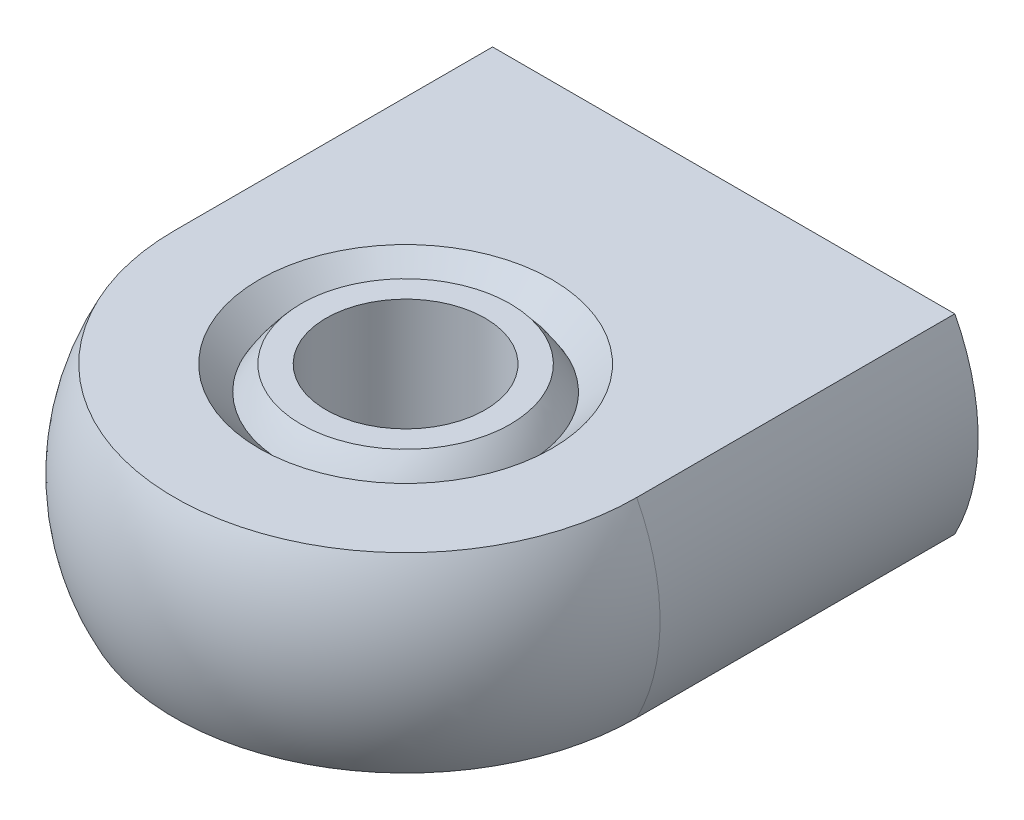
ISO-10303-21;
HEADER;
FILE_DESCRIPTION(('STEP AP214'),'2;1');
FILE_NAME('part.step','',(''),(''),'','','');
FILE_SCHEMA(('AUTOMOTIVE_DESIGN { 1 0 10303 214 1 1 1 1 }'));
ENDSEC;
DATA;
#1=APPLICATION_CONTEXT('core data for automotive mechanical design processes');
#2=APPLICATION_PROTOCOL_DEFINITION('international standard','automotive_design',2000,#1);
#3=PRODUCT_CONTEXT('',#1,'mechanical');
#4=PRODUCT('Part','Part','',(#3));
#5=PRODUCT_RELATED_PRODUCT_CATEGORY('part','',(#4));
#6=PRODUCT_DEFINITION_FORMATION('','',#4);
#7=PRODUCT_DEFINITION_CONTEXT('part definition',#1,'design');
#8=PRODUCT_DEFINITION('design','',#6,#7);
#9=PRODUCT_DEFINITION_SHAPE('','',#8);
#10=(LENGTH_UNIT() NAMED_UNIT(*) SI_UNIT(.MILLI.,.METRE.));
#11=(NAMED_UNIT(*) PLANE_ANGLE_UNIT() SI_UNIT($,.RADIAN.));
#12=(NAMED_UNIT(*) SI_UNIT($,.STERADIAN.) SOLID_ANGLE_UNIT());
#13=UNCERTAINTY_MEASURE_WITH_UNIT(LENGTH_MEASURE(1.E-05),#10,'distance_accuracy_value','');
#14=(GEOMETRIC_REPRESENTATION_CONTEXT(3) GLOBAL_UNCERTAINTY_ASSIGNED_CONTEXT((#13)) GLOBAL_UNIT_ASSIGNED_CONTEXT((#10,
#11,#12)) REPRESENTATION_CONTEXT('',''));
#15=CARTESIAN_POINT('',(0.,0.,0.));
#16=DIRECTION('',(0.,0.,1.));
#17=DIRECTION('',(1.,0.,0.));
#18=AXIS2_PLACEMENT_3D('',#15,#16,#17);
#19=CARTESIAN_POINT('',(0.,3.,10.));
#20=DIRECTION('',(0.,-1.,0.));
#21=DIRECTION('',(0.,0.,-1.));
#22=AXIS2_PLACEMENT_3D('',#19,#20,#21);
#23=PLANE('',#22);
#24=CARTESIAN_POINT('',(0.,3.,6.71463837606878));
#25=CARTESIAN_POINT('',(0.184540214436019,2.99999999999999,6.71464655939698));
#26=CARTESIAN_POINT('',(0.369214237918471,3.,6.73023910649915));
#27=CARTESIAN_POINT('',(0.733476245922316,3.,6.79222449184704));
#28=CARTESIAN_POINT('',(0.913057837587483,2.99999999999998,6.83865439971082));
#29=CARTESIAN_POINT('',(1.26180505753317,2.99999999999998,6.96099275468467));
#30=CARTESIAN_POINT('',(1.43097561574846,3.,7.03688712310791));
#31=CARTESIAN_POINT('',(1.75412653641141,3.,7.2159806981764));
#32=CARTESIAN_POINT('',(1.90811066294535,2.99999999999998,7.31917311530025));
#33=CARTESIAN_POINT('',(2.19658801520011,2.99999999999998,7.54995437004746));
#34=CARTESIAN_POINT('',(2.33107919969152,3.,7.67754575940169));
#35=CARTESIAN_POINT('',(2.57673683659356,3.,7.95350176270609));
#36=CARTESIAN_POINT('',(2.68790237304686,3.,8.10186719203514));
#37=CARTESIAN_POINT('',(2.88374490574046,3.,8.41515267583666));
#38=CARTESIAN_POINT('',(2.96842239527254,3.,8.58007242193947));
#39=CARTESIAN_POINT('',(3.10888764141324,3.,8.92178692589578));
#40=CARTESIAN_POINT('',(3.16467545611322,3.,9.09858165987025));
#41=CARTESIAN_POINT('',(3.24577806942483,3.,9.45902810274011));
#42=CARTESIAN_POINT('',(3.2710928099438,3.,9.6426798247067));
#43=CARTESIAN_POINT('',(3.29053044273158,3.,10.0116262500505));
#44=CARTESIAN_POINT('',(3.28465339120488,3.,10.1969209504665));
#45=CARTESIAN_POINT('',(3.2418743966303,3.,10.5638937671981));
#46=CARTESIAN_POINT('',(3.2049724420056,3.,10.7455718821641));
#47=CARTESIAN_POINT('',(3.1011911068813,3.,11.1001543420333));
#48=CARTESIAN_POINT('',(3.03431169473731,3.,11.2730586776747));
#49=CARTESIAN_POINT('',(2.87247397468746,3.,11.6051850672987));
#50=CARTESIAN_POINT('',(2.77751567591908,3.,11.7644071257338));
#51=CARTESIAN_POINT('',(2.56221580628186,3.,12.0646491154296));
#52=CARTESIAN_POINT('',(2.44187424568733,3.,12.2056690540579));
#53=CARTESIAN_POINT('',(2.17922395287968,3.,12.4655037579028));
#54=CARTESIAN_POINT('',(2.03691521765614,3.,12.5843185200764));
#55=CARTESIAN_POINT('',(1.73437029383715,3.,12.7963700595387));
#56=CARTESIAN_POINT('',(1.57413410289888,3.,12.8896068334847));
#57=CARTESIAN_POINT('',(1.24028292490615,3.,13.047855654279));
#58=CARTESIAN_POINT('',(1.06666793842452,3.00000000000001,13.1128677023358));
#59=CARTESIAN_POINT('',(0.71098759058229,2.99999999999999,13.2128215739559));
#60=CARTESIAN_POINT('',(0.528922229602384,2.99999999999995,13.2477633988739));
#61=CARTESIAN_POINT('',(0.161509425560859,2.99999999999995,13.2865849335575));
#62=CARTESIAN_POINT('',(-0.0238380175007591,2.99999999999999,13.2904646433232));
#63=CARTESIAN_POINT('',(-0.392553525309017,3.00000000000001,13.2670518136197));
#64=CARTESIAN_POINT('',(-0.575921589966484,2.99999999999998,13.2397592727462));
#65=CARTESIAN_POINT('',(-0.935473059733511,2.99999999999998,13.1547766926589));
#66=CARTESIAN_POINT('',(-1.11165646453545,3.,13.0970866521435));
#67=CARTESIAN_POINT('',(-1.45183725444223,3.,12.9529467322901));
#68=CARTESIAN_POINT('',(-1.61583464113957,2.99999999999998,12.8664968567104));
#69=CARTESIAN_POINT('',(-1.92698799589898,2.99999999999998,12.6672913360638));
#70=CARTESIAN_POINT('',(-2.07414396626901,3.00000000000001,12.5545356946018));
#71=CARTESIAN_POINT('',(-2.34743724622342,2.99999999999999,12.3059193850522));
#72=CARTESIAN_POINT('',(-2.47357454730012,2.99999999999995,12.1700587076124));
#73=CARTESIAN_POINT('',(-2.70124978473096,2.99999999999995,11.8790889968582));
#74=CARTESIAN_POINT('',(-2.80278771307992,2.99999999999999,11.7239799572799));
#75=CARTESIAN_POINT('',(-2.97838169242038,3.00000000000001,11.3989168237405));
#76=CARTESIAN_POINT('',(-3.05243777242186,3.,11.2289627454501));
#77=CARTESIAN_POINT('',(-3.17096595278941,3.,10.8790339511855));
#78=CARTESIAN_POINT('',(-3.21543806419461,3.,10.6990592389504));
#79=CARTESIAN_POINT('',(-3.27353597125844,3.,10.3341977316122));
#80=CARTESIAN_POINT('',(-3.28716171133485,3.,10.1493109276585));
#81=CARTESIAN_POINT('',(-3.28317992885849,3.,9.77987430593317));
#82=CARTESIAN_POINT('',(-3.26557246584732,3.,9.59532448751979));
#83=CARTESIAN_POINT('',(-3.19962411823861,3.,9.23179993121697));
#84=CARTESIAN_POINT('',(-3.15128317184201,3.,9.05282520453873));
#85=CARTESIAN_POINT('',(-3.02523900140316,3.,8.70552856034104));
#86=CARTESIAN_POINT('',(-2.94753523051581,3.,8.53720684128842));
#87=CARTESIAN_POINT('',(-2.76497448162107,3.,8.21600447004712));
#88=CARTESIAN_POINT('',(-2.660118569751,3.,8.06312321191147));
#89=CARTESIAN_POINT('',(-2.4262425699382,3.,7.77714910990541));
#90=CARTESIAN_POINT('',(-2.29722501143736,3.,7.64405419724994));
#91=CARTESIAN_POINT('',(-2.01863888071717,3.,7.40137994248345));
#92=CARTESIAN_POINT('',(-1.86906520858562,2.99999999999999,7.29180645330691));
#93=CARTESIAN_POINT('',(-1.55358670077527,3.,7.09928474640792));
#94=CARTESIAN_POINT('',(-1.38767410171386,3.00000000000002,7.01634926617226));
#95=CARTESIAN_POINT('',(-1.04441020910324,2.99999999999998,6.87960535039713));
#96=CARTESIAN_POINT('',(-0.867072914440428,2.99999999999991,6.82576199986985));
#97=CARTESIAN_POINT('',(-0.573837868394774,2.99999999999994,6.76308121486834));
#98=CARTESIAN_POINT('',(-0.459845492831498,2.99999999999998,6.74493782192496));
#99=CARTESIAN_POINT('',(-0.230586162331747,3.00000000000002,6.72071384564368));
#100=CARTESIAN_POINT('',(-0.115319207395271,3.00000000000001,6.71463326230577));
#101=CARTESIAN_POINT('',(0.,3.,6.71463837606878));
#102=B_SPLINE_CURVE_WITH_KNOTS('',3,(#24,#25,#26,#27,#28,#29,#30,#31,#32,#33,#34,#35,#36,#37,
#38,#39,#40,#41,#42,#43,#44,#45,#46,#47,#48,#49,#50,#51,#52,#53,#54,#55,#56,#57,#58,#59,#60,#61,
#62,#63,#64,#65,#66,#67,#68,#69,#70,#71,#72,#73,#74,#75,#76,#77,#78,#79,#80,#81,#82,#83,#84,#85,
#86,#87,#88,#89,#90,#91,#92,#93,#94,#95,#96,#97,#98,#99,#100,#101),.UNSPECIFIED.,.T.,.F.,(4,2,2,
2,2,2,2,2,2,2,2,2,2,2,2,2,2,2,2,2,2,2,2,2,2,2,2,2,2,2,2,2,2,2,2,2,2,2,4),(0.,0.553199728442341,
1.10706566528163,1.66066727938189,2.21413133193493,2.76765329940548,3.32119699864778,
3.87473038852956,4.42826266536216,4.98179599742512,5.53532833207654,6.08886087327669,
6.64239399879092,7.19592694417384,7.7494596655053,8.30299246269377,8.85652533221968,
9.41005817804545,9.96359099893405,10.5171238198227,11.0706566656484,11.6241895351744,
12.1777223323628,12.7312550536943,13.2847879990772,13.8383211245915,14.3918536657916,
14.945386000443,15.498919332506,16.0524516093386,16.6059849992204,17.1595286984627,
17.7130506659332,18.2665147184863,18.8201163325865,19.3739822694258,19.9271819978681,
20.2728765902918,20.6185711827156),.UNSPECIFIED.);
#103=CARTESIAN_POINT('',(0.,3.,6.71463837606878));
#104=VERTEX_POINT('',#103);
#105=EDGE_CURVE('P0_E70',#104,#104,#102,.T.);
#106=ORIENTED_EDGE('',*,*,#105,.F.);
#107=EDGE_LOOP('',(#106));
#108=FACE_BOUND('',#107,.T.);
#109=CARTESIAN_POINT('',(0.,3.,10.));
#110=DIRECTION('',(0.,-1.,0.));
#111=DIRECTION('',(0.,0.,-1.));
#112=AXIS2_PLACEMENT_3D('',#109,#110,#111);
#113=CIRCLE('',#112,2.5);
#114=CARTESIAN_POINT('',(0.,3.,7.5));
#115=VERTEX_POINT('',#114);
#116=EDGE_CURVE('P0_E75',#115,#115,#113,.T.);
#117=ORIENTED_EDGE('',*,*,#116,.T.);
#118=EDGE_LOOP('',(#117));
#119=FACE_BOUND('',#118,.T.);
#120=ADVANCED_FACE('P0_F17',(#108,#119),#23,.F.);
#121=CARTESIAN_POINT('',(0.,0.,10.));
#122=DIRECTION('',(0.,-1.,0.));
#123=DIRECTION('',(0.,0.,-1.));
#124=AXIS2_PLACEMENT_3D('',#121,#122,#123);
#125=CYLINDRICAL_SURFACE('',#124,2.5);
#126=CARTESIAN_POINT('',(0.,-3.,10.));
#127=DIRECTION('',(0.,-1.,0.));
#128=DIRECTION('',(0.,0.,-1.));
#129=AXIS2_PLACEMENT_3D('',#126,#127,#128);
#130=CIRCLE('',#129,2.5);
#131=CARTESIAN_POINT('',(0.,-3.,7.5));
#132=VERTEX_POINT('',#131);
#133=EDGE_CURVE('P0_E41',#132,#132,#130,.F.);
#134=ORIENTED_EDGE('',*,*,#133,.F.);
#135=EDGE_LOOP('',(#134));
#136=FACE_BOUND('',#135,.T.);
#137=ORIENTED_EDGE('',*,*,#116,.F.);
#138=EDGE_LOOP('',(#137));
#139=FACE_BOUND('',#138,.T.);
#140=ADVANCED_FACE('P0_F66',(#136,#139),#125,.F.);
#141=CARTESIAN_POINT('',(0.,-3.,10.));
#142=DIRECTION('',(0.,-1.,0.));
#143=DIRECTION('',(0.,0.,-1.));
#144=AXIS2_PLACEMENT_3D('',#141,#142,#143);
#145=PLANE('',#144);
#146=CARTESIAN_POINT('',(0.,-3.,13.2853616239312));
#147=CARTESIAN_POINT('',(0.184540214436019,-3.,13.285353440603));
#148=CARTESIAN_POINT('',(0.369214237918471,-3.,13.2697608935009));
#149=CARTESIAN_POINT('',(0.733476245922316,-3.,13.207775508153));
#150=CARTESIAN_POINT('',(0.913057837587483,-2.99999999999999,13.1613456002892));
#151=CARTESIAN_POINT('',(1.26180505753317,-2.99999999999999,13.0390072453153));
#152=CARTESIAN_POINT('',(1.43097561574846,-3.,12.9631128768921));
#153=CARTESIAN_POINT('',(1.7541265364114,-3.,12.7840193018236));
#154=CARTESIAN_POINT('',(1.90811066294535,-2.99999999999999,12.6808268846997));
#155=CARTESIAN_POINT('',(2.19658801520011,-2.99999999999999,12.4500456299525));
#156=CARTESIAN_POINT('',(2.33107919969152,-3.,12.3224542405983));
#157=CARTESIAN_POINT('',(2.57673683659356,-3.,12.0464982372939));
#158=CARTESIAN_POINT('',(2.68790237304687,-3.,11.8981328079649));
#159=CARTESIAN_POINT('',(2.88374490574046,-3.,11.5848473241633));
#160=CARTESIAN_POINT('',(2.96842239527254,-3.,11.4199275780605));
#161=CARTESIAN_POINT('',(3.10888764141324,-3.,11.0782130741042));
#162=CARTESIAN_POINT('',(3.16467545611322,-3.,10.9014183401298));
#163=CARTESIAN_POINT('',(3.24577806942483,-3.,10.5409718972599));
#164=CARTESIAN_POINT('',(3.2710928099438,-3.,10.3573201752933));
#165=CARTESIAN_POINT('',(3.29053044273158,-3.,9.98837374994954));
#166=CARTESIAN_POINT('',(3.28465339120488,-3.,9.80307904953347));
#167=CARTESIAN_POINT('',(3.2418743966303,-3.,9.43610623280186));
#168=CARTESIAN_POINT('',(3.2049724420056,-3.,9.25442811783587));
#169=CARTESIAN_POINT('',(3.1011911068813,-3.,8.89984565796666));
#170=CARTESIAN_POINT('',(3.03431169473731,-3.,8.72694132232532));
#171=CARTESIAN_POINT('',(2.87247397468746,-3.,8.39481493270134));
#172=CARTESIAN_POINT('',(2.77751567591908,-3.,8.23559287426622));
#173=CARTESIAN_POINT('',(2.56221580628186,-3.,7.9353508845704));
#174=CARTESIAN_POINT('',(2.44187424568733,-3.,7.79433094594213));
#175=CARTESIAN_POINT('',(2.17922395287968,-3.,7.53449624209718));
#176=CARTESIAN_POINT('',(2.03691521765614,-3.,7.41568147992355));
#177=CARTESIAN_POINT('',(1.73437029383715,-3.,7.20362994046131));
#178=CARTESIAN_POINT('',(1.57413410289888,-3.,7.11039316651531));
#179=CARTESIAN_POINT('',(1.24028292490615,-3.,6.952144345721));
#180=CARTESIAN_POINT('',(1.06666793842452,-3.00000000000001,6.88713229766421));
#181=CARTESIAN_POINT('',(0.71098759058229,-2.99999999999999,6.78717842604412));
#182=CARTESIAN_POINT('',(0.528922229602383,-2.99999999999998,6.75223660112612));
#183=CARTESIAN_POINT('',(0.161509425560859,-2.99999999999998,6.71341506644247));
#184=CARTESIAN_POINT('',(-0.023838017500759,-3.,6.70953535667681));
#185=CARTESIAN_POINT('',(-0.392553525309017,-3.,6.73294818638032));
#186=CARTESIAN_POINT('',(-0.575921589966484,-2.99999999999999,6.76024072725383));
#187=CARTESIAN_POINT('',(-0.935473059733511,-2.99999999999999,6.84522330734114));
#188=CARTESIAN_POINT('',(-1.11165646453545,-3.,6.90291334785645));
#189=CARTESIAN_POINT('',(-1.45183725444223,-3.,7.04705326770988));
#190=CARTESIAN_POINT('',(-1.61583464113957,-2.99999999999999,7.13350314328956));
#191=CARTESIAN_POINT('',(-1.92698799589898,-2.99999999999999,7.33270866393622));
#192=CARTESIAN_POINT('',(-2.074143966269,-3.,7.44546430539821));
#193=CARTESIAN_POINT('',(-2.34743724622341,-3.,7.69408061494783));
#194=CARTESIAN_POINT('',(-2.47357454730012,-2.99999999999998,7.82994129238757));
#195=CARTESIAN_POINT('',(-2.70124978473096,-2.99999999999998,8.12091100314181));
#196=CARTESIAN_POINT('',(-2.80278771307991,-2.99999999999999,8.27602004272011));
#197=CARTESIAN_POINT('',(-2.97838169242038,-3.00000000000001,8.60108317625952));
#198=CARTESIAN_POINT('',(-3.05243777242186,-3.,8.7710372545499));
#199=CARTESIAN_POINT('',(-3.17096595278941,-3.,9.12096604881453));
#200=CARTESIAN_POINT('',(-3.21543806419461,-3.,9.30094076104959));
#201=CARTESIAN_POINT('',(-3.27353597125844,-3.,9.66580226838783));
#202=CARTESIAN_POINT('',(-3.28716171133485,-3.,9.85068907234151));
#203=CARTESIAN_POINT('',(-3.28317992885849,-3.,10.2201256940668));
#204=CARTESIAN_POINT('',(-3.26557246584732,-3.,10.4046755124802));
#205=CARTESIAN_POINT('',(-3.19962411823861,-3.,10.768200068783));
#206=CARTESIAN_POINT('',(-3.15128317184201,-3.,10.9471747954613));
#207=CARTESIAN_POINT('',(-3.02523900140316,-3.,11.294471439659));
#208=CARTESIAN_POINT('',(-2.94753523051581,-3.,11.4627931587116));
#209=CARTESIAN_POINT('',(-2.76497448162107,-3.,11.7839955299529));
#210=CARTESIAN_POINT('',(-2.660118569751,-3.,11.9368767880885));
#211=CARTESIAN_POINT('',(-2.4262425699382,-3.,12.2228508900946));
#212=CARTESIAN_POINT('',(-2.29722501143736,-3.,12.3559458027501));
#213=CARTESIAN_POINT('',(-2.01863888071717,-3.,12.5986200575166));
#214=CARTESIAN_POINT('',(-1.86906520858562,-3.,12.7081935466931));
#215=CARTESIAN_POINT('',(-1.55358670077527,-3.00000000000001,12.9007152535921));
#216=CARTESIAN_POINT('',(-1.38767410171386,-3.00000000000001,12.9836507338277));
#217=CARTESIAN_POINT('',(-1.04441020910324,-2.99999999999999,13.1203946496029));
#218=CARTESIAN_POINT('',(-0.867072914440427,-2.99999999999995,13.1742380001302));
#219=CARTESIAN_POINT('',(-0.573837868394773,-2.99999999999997,13.2369187851317));
#220=CARTESIAN_POINT('',(-0.459845492831498,-2.99999999999999,13.255062178075));
#221=CARTESIAN_POINT('',(-0.230586162331747,-3.00000000000001,13.2792861543563));
#222=CARTESIAN_POINT('',(-0.115319207395271,-3.,13.2853667376942));
#223=CARTESIAN_POINT('',(0.,-3.,13.2853616239312));
#224=B_SPLINE_CURVE_WITH_KNOTS('',3,(#146,#147,#148,#149,#150,#151,#152,#153,#154,#155,#156,
#157,#158,#159,#160,#161,#162,#163,#164,#165,#166,#167,#168,#169,#170,#171,#172,#173,#174,#175,
#176,#177,#178,#179,#180,#181,#182,#183,#184,#185,#186,#187,#188,#189,#190,#191,#192,#193,#194,
#195,#196,#197,#198,#199,#200,#201,#202,#203,#204,#205,#206,#207,#208,#209,#210,#211,#212,#213,
#214,#215,#216,#217,#218,#219,#220,#221,#222,#223),.UNSPECIFIED.,.T.,.F.,(4,2,2,2,2,2,2,2,2,2,2,
2,2,2,2,2,2,2,2,2,2,2,2,2,2,2,2,2,2,2,2,2,2,2,2,2,2,2,4),(0.,0.553199728442341,1.10706566528163,
1.66066727938189,2.21413133193493,2.76765329940548,3.32119699864779,3.87473038852956,
4.42826266536216,4.98179599742512,5.53532833207654,6.08886087327669,6.64239399879092,
7.19592694417384,7.7494596655053,8.30299246269377,8.85652533221968,9.41005817804545,
9.96359099893405,10.5171238198227,11.0706566656484,11.6241895351744,12.1777223323628,
12.7312550536943,13.2847879990772,13.8383211245915,14.3918536657916,14.945386000443,
15.498919332506,16.0524516093386,16.6059849992204,17.1595286984627,17.7130506659332,
18.2665147184862,18.8201163325865,19.3739822694258,19.9271819978681,20.2728765902918,
20.6185711827156),.UNSPECIFIED.);
#225=CARTESIAN_POINT('',(0.,-3.,13.2853616239312));
#226=VERTEX_POINT('',#225);
#227=EDGE_CURVE('P0_E11',#226,#226,#224,.T.);
#228=ORIENTED_EDGE('',*,*,#227,.F.);
#229=EDGE_LOOP('',(#228));
#230=FACE_BOUND('',#229,.T.);
#231=ORIENTED_EDGE('',*,*,#133,.T.);
#232=EDGE_LOOP('',(#231));
#233=FACE_BOUND('',#232,.T.);
#234=ADVANCED_FACE('P0_F59',(#230,#233),#145,.T.);
#235=CARTESIAN_POINT('',(0.,0.,10.));
#236=DIRECTION('',(1.,0.,0.));
#237=DIRECTION('',(0.,1.,0.));
#238=AXIS2_PLACEMENT_3D('',#235,#236,#237);
#239=SPHERICAL_SURFACE('',#238,4.449);
#240=CARTESIAN_POINT('',(4.449,0.,10.));
#241=VERTEX_POINT('',#240);
#242=VERTEX_LOOP('',#241);
#243=FACE_BOUND('',#242,.T.);
#244=ORIENTED_EDGE('',*,*,#227,.T.);
#245=EDGE_LOOP('',(#244));
#246=FACE_BOUND('',#245,.T.);
#247=CARTESIAN_POINT('',(-4.449,0.,10.));
#248=CARTESIAN_POINT('',(-4.44900154419796,0.,9.9272033342173));
#249=CARTESIAN_POINT('',(-4.4472133577898,0.,9.85440679983071));
#250=CARTESIAN_POINT('',(-4.44006861152382,0.,9.70898903400392));
#251=CARTESIAN_POINT('',(-4.43471205166599,0.,9.63636780256372));
#252=CARTESIAN_POINT('',(-4.42044164626322,0.,9.49147568278385));
#253=CARTESIAN_POINT('',(-4.41152780071827,0.,9.41920479444419));
#254=CARTESIAN_POINT('',(-4.39016478494835,0.,9.275187443852));
#255=CARTESIAN_POINT('',(-4.37771561472336,0.,9.20344098159948));
#256=CARTESIAN_POINT('',(-4.34931181030458,0.,9.06064533310101));
#257=CARTESIAN_POINT('',(-4.33335717611078,0.,8.98959614685507));
#258=CARTESIAN_POINT('',(-4.29798091481427,0.,8.84836621236569));
#259=CARTESIAN_POINT('',(-4.27855928771157,0.,8.77818546412225));
#260=CARTESIAN_POINT('',(-4.23629581963362,0.,8.63886147766754));
#261=CARTESIAN_POINT('',(-4.21345397865837,0.,8.56971823945628));
#262=CARTESIAN_POINT('',(-4.16440511334015,0.,8.43263584505975));
#263=CARTESIAN_POINT('',(-4.13819808899717,0.,8.36469668887447));
#264=CARTESIAN_POINT('',(-4.08248199128826,0.,8.23018612994096));
#265=CARTESIAN_POINT('',(-4.05297291792232,0.,8.16361472719272));
#266=CARTESIAN_POINT('',(-3.99072381229007,0.,8.03200005146462));
#267=CARTESIAN_POINT('',(-3.95798378002376,0.,7.96695677848476));
#268=CARTESIAN_POINT('',(-3.8893516301479,0.,7.83855505723751));
#269=CARTESIAN_POINT('',(-3.85345951253836,0.,7.77519660897012));
#270=CARTESIAN_POINT('',(-3.77860965924406,0.,7.65031717319859));
#271=CARTESIAN_POINT('',(-3.73965192355932,0.,7.58879618569446));
#272=CARTESIAN_POINT('',(-3.65876468670873,0.,7.46773988089712));
#273=CARTESIAN_POINT('',(-3.61683518554288,0.,7.40820456360391));
#274=CARTESIAN_POINT('',(-3.5301054295719,0.,7.29126302502242));
#275=CARTESIAN_POINT('',(-3.48530517476677,0.,7.23385680373413));
#276=CARTESIAN_POINT('',(-3.39294183925486,0.,7.12131175377775));
#277=CARTESIAN_POINT('',(-3.34537875854807,0.,7.06617292510967));
#278=CARTESIAN_POINT('',(-3.24760435486035,0.,6.95829549466156));
#279=CARTESIAN_POINT('',(-3.19739303187943,0.,6.90555689288153));
#280=CARTESIAN_POINT('',(-3.09444310711847,0.,6.80260696812057));
#281=CARTESIAN_POINT('',(-3.04170450533844,0.,6.75239564513965));
#282=CARTESIAN_POINT('',(-2.93382707489033,0.,6.65462124145193));
#283=CARTESIAN_POINT('',(-2.87868824622224,0.,6.60705816074514));
#284=CARTESIAN_POINT('',(-2.76614319626587,0.,6.51469482523323));
#285=CARTESIAN_POINT('',(-2.70873697497758,0.,6.4698945704281));
#286=CARTESIAN_POINT('',(-2.59179543639609,0.,6.38316481445712));
#287=CARTESIAN_POINT('',(-2.53226011910288,0.,6.34123531329127));
#288=CARTESIAN_POINT('',(-2.41120381430554,0.,6.26034807644068));
#289=CARTESIAN_POINT('',(-2.3496828268014,0.,6.22139034075594));
#290=CARTESIAN_POINT('',(-2.22480339102988,0.,6.14654048746164));
#291=CARTESIAN_POINT('',(-2.16144494276249,0.,6.1106483698521));
#292=CARTESIAN_POINT('',(-2.03304322151524,0.,6.04201621997624));
#293=CARTESIAN_POINT('',(-1.96799994853537,0.,6.00927618770993));
#294=CARTESIAN_POINT('',(-1.83638527280727,0.,5.94702708207768));
#295=CARTESIAN_POINT('',(-1.76981387005904,0.,5.91751800871174));
#296=CARTESIAN_POINT('',(-1.63530331112553,0.,5.86180191100283));
#297=CARTESIAN_POINT('',(-1.56736415494026,0.,5.83559488665985));
#298=CARTESIAN_POINT('',(-1.43028176054372,0.,5.78654602134163));
#299=CARTESIAN_POINT('',(-1.36113852233245,0.,5.76370418036638));
#300=CARTESIAN_POINT('',(-1.22181453587775,0.,5.72144071228843));
#301=CARTESIAN_POINT('',(-1.15163378763431,0.,5.70201908518573));
#302=CARTESIAN_POINT('',(-1.01040385314493,0.,5.66664282388922));
#303=CARTESIAN_POINT('',(-0.939354666898987,0.,5.65068818969542));
#304=CARTESIAN_POINT('',(-0.796559018400521,0.,5.62228438527664));
#305=CARTESIAN_POINT('',(-0.724812556147997,0.,5.60983521505165));
#306=CARTESIAN_POINT('',(-0.580795205555811,0.,5.58847219928173));
#307=CARTESIAN_POINT('',(-0.508524317216148,0.,5.57955835373678));
#308=CARTESIAN_POINT('',(-0.363632197436281,0.,5.56528794833401));
#309=CARTESIAN_POINT('',(-0.291010965996077,0.,5.55993138847618));
#310=CARTESIAN_POINT('',(-0.145593200169287,0.,5.5527866422102));
#311=CARTESIAN_POINT('',(-0.0727966657826996,0.,5.55099845580204));
#312=CARTESIAN_POINT('',(0.,0.,5.551));
#313=B_SPLINE_CURVE_WITH_KNOTS('',3,(#247,#248,#249,#250,#251,#252,#253,#254,#255,#256,#257,
#258,#259,#260,#261,#262,#263,#264,#265,#266,#267,#268,#269,#270,#271,#272,#273,#274,#275,#276,
#277,#278,#279,#280,#281,#282,#283,#284,#285,#286,#287,#288,#289,#290,#291,#292,#293,#294,#295,
#296,#297,#298,#299,#300,#301,#302,#303,#304,#305,#306,#307,#308,#309,#310,#311,#312),
.UNSPECIFIED.,.F.,.F.,(4,2,2,2,2,2,2,2,2,2,2,2,2,2,2,2,2,2,2,2,2,2,2,2,2,2,2,2,2,2,2,2,4),(0.,
0.218367851396876,0.436735702793747,0.65510355419062,0.873471405587496,1.09183925698437,
1.31020710838124,1.52857495977811,1.74694281117499,1.96531066257186,2.18367851396874,
2.40204636536561,2.62041421676248,2.83878206815936,3.05714991955623,3.2755177709531,
3.49388562234998,3.71225347374685,3.93062132514372,4.1489891765406,4.36735702793747,
4.58572487933434,4.80409273073122,5.02246058212809,5.24082843352496,5.45919628492184,
5.67756413631871,5.89593198771558,6.11429983911246,6.33266769050933,6.5510355419062,
6.76940339330308,6.98777124469995),.UNSPECIFIED.);
#314=CARTESIAN_POINT('',(-4.449,0.,10.));
#315=VERTEX_POINT('',#314);
#316=CARTESIAN_POINT('',(0.,-7.87130777224476E-13,5.551));
#317=VERTEX_POINT('',#316);
#318=EDGE_CURVE('P0_E29',#315,#317,#313,.T.);
#319=ORIENTED_EDGE('',*,*,#318,.T.);
#320=ORIENTED_EDGE('',*,*,#318,.F.);
#321=EDGE_LOOP('',(#319,#320));
#322=FACE_BOUND('',#321,.T.);
#323=ORIENTED_EDGE('',*,*,#105,.T.);
#324=EDGE_LOOP('',(#323));
#325=FACE_BOUND('',#324,.T.);
#326=ADVANCED_FACE('P0_F39',(#243,#246,#322,#325),#239,.T.);
#327=CLOSED_SHELL('',(#120,#140,#234,#326));
#328=MANIFOLD_SOLID_BREP('P0_B1',#327);
#329=CARTESIAN_POINT('',(-5.,0.,6.50000000001683));
#330=DIRECTION('',(0.,0.,-1.));
#331=DIRECTION('',(0.,1.,0.));
#332=AXIS2_PLACEMENT_3D('',#329,#330,#331);
#333=CONICAL_SURFACE('',#332,1.25000000002274,0.785398163420186);
#334=CARTESIAN_POINT('',(-5.,0.,7.74999999993042));
#335=VERTEX_POINT('',#334);
#336=VERTEX_LOOP('',#335);
#337=FACE_BOUND('',#336,.T.);
#338=CARTESIAN_POINT('',(-5.,0.,6.5));
#339=DIRECTION('',(0.,0.,-1.));
#340=DIRECTION('',(-1.,0.,0.));
#341=AXIS2_PLACEMENT_3D('',#338,#339,#340);
#342=CIRCLE('',#341,1.25);
#343=CARTESIAN_POINT('',(-6.25,0.,6.5));
#344=VERTEX_POINT('',#343);
#345=EDGE_CURVE('P1_E204',#344,#344,#342,.T.);
#346=ORIENTED_EDGE('',*,*,#345,.T.);
#347=EDGE_LOOP('',(#346));
#348=FACE_BOUND('',#347,.T.);
#349=ADVANCED_FACE('P1_F16',(#337,#348),#333,.F.);
#350=CARTESIAN_POINT('',(5.,0.,6.50000000001683));
#351=DIRECTION('',(0.,0.,-1.));
#352=DIRECTION('',(0.,1.,0.));
#353=AXIS2_PLACEMENT_3D('',#350,#351,#352);
#354=CONICAL_SURFACE('',#353,1.25000000002274,0.785398163420186);
#355=CARTESIAN_POINT('',(5.,0.,7.74999999993042));
#356=VERTEX_POINT('',#355);
#357=VERTEX_LOOP('',#356);
#358=FACE_BOUND('',#357,.T.);
#359=CARTESIAN_POINT('',(5.,0.,6.5));
#360=DIRECTION('',(0.,0.,-1.));
#361=DIRECTION('',(-1.,0.,0.));
#362=AXIS2_PLACEMENT_3D('',#359,#360,#361);
#363=CIRCLE('',#362,1.25);
#364=CARTESIAN_POINT('',(3.75,0.,6.5));
#365=VERTEX_POINT('',#364);
#366=EDGE_CURVE('P1_E201',#365,#365,#363,.T.);
#367=ORIENTED_EDGE('',*,*,#366,.T.);
#368=EDGE_LOOP('',(#367));
#369=FACE_BOUND('',#368,.T.);
#370=ADVANCED_FACE('P1_F359',(#358,#369),#354,.F.);
#371=CARTESIAN_POINT('',(-5.,0.,3.525));
#372=DIRECTION('',(0.,0.,-1.));
#373=DIRECTION('',(-1.,0.,0.));
#374=AXIS2_PLACEMENT_3D('',#371,#372,#373);
#375=CYLINDRICAL_SURFACE('',#374,1.25);
#376=CARTESIAN_POINT('',(-5.,0.,0.549999999918782));
#377=DIRECTION('',(0.,0.,-1.));
#378=DIRECTION('',(-1.,0.,0.));
#379=AXIS2_PLACEMENT_3D('',#376,#377,#378);
#380=CIRCLE('',#379,1.25000000002274);
#381=CARTESIAN_POINT('',(-6.25000000002274,0.,0.549999999918782));
#382=VERTEX_POINT('',#381);
#383=EDGE_CURVE('P1_E198',#382,#382,#380,.T.);
#384=ORIENTED_EDGE('',*,*,#383,.T.);
#385=EDGE_LOOP('',(#384));
#386=FACE_BOUND('',#385,.T.);
#387=ORIENTED_EDGE('',*,*,#345,.F.);
#388=EDGE_LOOP('',(#387));
#389=FACE_BOUND('',#388,.T.);
#390=ADVANCED_FACE('P1_F355',(#386,#389),#375,.F.);
#391=CARTESIAN_POINT('',(5.,0.,3.525));
#392=DIRECTION('',(0.,0.,-1.));
#393=DIRECTION('',(-1.,0.,0.));
#394=AXIS2_PLACEMENT_3D('',#391,#392,#393);
#395=CYLINDRICAL_SURFACE('',#394,1.25);
#396=CARTESIAN_POINT('',(5.,0.,0.549999999918782));
#397=DIRECTION('',(0.,0.,-1.));
#398=DIRECTION('',(1.,0.,0.));
#399=AXIS2_PLACEMENT_3D('',#396,#397,#398);
#400=CIRCLE('',#399,1.25000000002274);
#401=CARTESIAN_POINT('',(6.25000000002274,0.,0.549999999918782));
#402=VERTEX_POINT('',#401);
#403=EDGE_CURVE('P1_E189',#402,#402,#400,.T.);
#404=ORIENTED_EDGE('',*,*,#403,.T.);
#405=EDGE_LOOP('',(#404));
#406=FACE_BOUND('',#405,.T.);
#407=ORIENTED_EDGE('',*,*,#366,.F.);
#408=EDGE_LOOP('',(#407));
#409=FACE_BOUND('',#408,.T.);
#410=ADVANCED_FACE('P1_F352',(#406,#409),#395,.F.);
#411=CARTESIAN_POINT('',(-5.,0.,0.200000000006639));
#412=DIRECTION('',(0.,0.,-1.));
#413=DIRECTION('',(-1.,0.,0.));
#414=AXIS2_PLACEMENT_3D('',#411,#412,#413);
#415=CONICAL_SURFACE('',#414,1.59999999993488,0.785398163397448);
#416=CARTESIAN_POINT('',(-5.,0.,0.2));
#417=DIRECTION('',(0.,0.,-1.));
#418=DIRECTION('',(-1.,0.,0.));
#419=AXIS2_PLACEMENT_3D('',#416,#417,#418);
#420=CIRCLE('',#419,1.6);
#421=CARTESIAN_POINT('',(-6.6,0.,0.2));
#422=VERTEX_POINT('',#421);
#423=EDGE_CURVE('P1_E229',#422,#422,#420,.T.);
#424=ORIENTED_EDGE('',*,*,#423,.T.);
#425=EDGE_LOOP('',(#424));
#426=FACE_BOUND('',#425,.T.);
#427=ORIENTED_EDGE('',*,*,#383,.F.);
#428=EDGE_LOOP('',(#427));
#429=FACE_BOUND('',#428,.T.);
#430=ADVANCED_FACE('P1_F347',(#426,#429),#415,.F.);
#431=CARTESIAN_POINT('',(5.,0.,0.200000000006639));
#432=DIRECTION('',(0.,0.,-1.));
#433=DIRECTION('',(-1.,0.,0.));
#434=AXIS2_PLACEMENT_3D('',#431,#432,#433);
#435=CONICAL_SURFACE('',#434,1.59999999993488,0.785398163397448);
#436=CARTESIAN_POINT('',(5.,0.,0.2));
#437=DIRECTION('',(0.,0.,-1.));
#438=DIRECTION('',(-1.,0.,0.));
#439=AXIS2_PLACEMENT_3D('',#436,#437,#438);
#440=CIRCLE('',#439,1.6);
#441=CARTESIAN_POINT('',(3.4,0.,0.2));
#442=VERTEX_POINT('',#441);
#443=EDGE_CURVE('P1_E164',#442,#442,#440,.T.);
#444=ORIENTED_EDGE('',*,*,#443,.T.);
#445=EDGE_LOOP('',(#444));
#446=FACE_BOUND('',#445,.T.);
#447=ORIENTED_EDGE('',*,*,#403,.F.);
#448=EDGE_LOOP('',(#447));
#449=FACE_BOUND('',#448,.T.);
#450=ADVANCED_FACE('P1_F236',(#446,#449),#435,.F.);
#451=CARTESIAN_POINT('',(0.,0.,4.));
#452=DIRECTION('',(0.,0.,1.));
#453=DIRECTION('',(1.,0.,0.));
#454=AXIS2_PLACEMENT_3D('',#451,#452,#453);
#455=PLANE('',#454);
#456=DIRECTION('',(1.,0.,0.));
#457=VECTOR('',#456,1.);
#458=CARTESIAN_POINT('',(0.,-2.,4.));
#459=LINE('',#458,#457);
#460=CARTESIAN_POINT('',(-2.25,-2.,4.));
#461=VERTEX_POINT('',#460);
#462=CARTESIAN_POINT('',(2.25,-2.,4.));
#463=VERTEX_POINT('',#462);
#464=EDGE_CURVE('P1_E63',#461,#463,#459,.T.);
#465=ORIENTED_EDGE('',*,*,#464,.F.);
#466=DIRECTION('',(0.,1.,0.));
#467=VECTOR('',#466,1.);
#468=CARTESIAN_POINT('',(-2.25,0.,4.));
#469=LINE('',#468,#467);
#470=CARTESIAN_POINT('',(-2.25,2.,4.));
#471=VERTEX_POINT('',#470);
#472=EDGE_CURVE('P1_E155',#471,#461,#469,.F.);
#473=ORIENTED_EDGE('',*,*,#472,.F.);
#474=DIRECTION('',(1.,0.,0.));
#475=VECTOR('',#474,1.);
#476=CARTESIAN_POINT('',(0.,2.,4.));
#477=LINE('',#476,#475);
#478=CARTESIAN_POINT('',(2.25,2.,4.));
#479=VERTEX_POINT('',#478);
#480=EDGE_CURVE('P1_E159',#479,#471,#477,.F.);
#481=ORIENTED_EDGE('',*,*,#480,.F.);
#482=DIRECTION('',(0.,1.,0.));
#483=VECTOR('',#482,1.);
#484=CARTESIAN_POINT('',(2.25,0.,4.));
#485=LINE('',#484,#483);
#486=EDGE_CURVE('P1_E122',#463,#479,#485,.T.);
#487=ORIENTED_EDGE('',*,*,#486,.F.);
#488=EDGE_LOOP('',(#465,#473,#481,#487));
#489=FACE_BOUND('',#488,.T.);
#490=ADVANCED_FACE('P1_F340',(#489),#455,.F.);
#491=CARTESIAN_POINT('',(0.,2.99999999992906,10.));
#492=DIRECTION('',(0.,1.,0.));
#493=DIRECTION('',(0.,0.,1.));
#494=AXIS2_PLACEMENT_3D('',#491,#492,#493);
#495=CONICAL_SURFACE('',#494,4.59999999992533,0.785398163397448);
#496=CARTESIAN_POINT('',(0.,3.00000000004275,10.));
#497=DIRECTION('',(0.,1.,0.));
#498=DIRECTION('',(0.,0.,1.));
#499=AXIS2_PLACEMENT_3D('',#496,#497,#498);
#500=CIRCLE('',#499,4.60000000003902);
#501=CARTESIAN_POINT('',(0.,3.00000000004275,14.600000000039));
#502=VERTEX_POINT('',#501);
#503=EDGE_CURVE('P1_E152',#502,#502,#500,.F.);
#504=ORIENTED_EDGE('',*,*,#503,.F.);
#505=EDGE_LOOP('',(#504));
#506=FACE_BOUND('',#505,.T.);
#507=CARTESIAN_POINT('',(0.,2.24323019176609,10.));
#508=DIRECTION('',(0.,1.,0.));
#509=DIRECTION('',(0.,0.,1.));
#510=AXIS2_PLACEMENT_3D('',#507,#508,#509);
#511=CIRCLE('',#510,3.84323019176236);
#512=CARTESIAN_POINT('',(0.,2.24323019176609,13.8432301917624));
#513=VERTEX_POINT('',#512);
#514=EDGE_CURVE('P1_E197',#513,#513,#511,.T.);
#515=ORIENTED_EDGE('',*,*,#514,.F.);
#516=EDGE_LOOP('',(#515));
#517=FACE_BOUND('',#516,.T.);
#518=ADVANCED_FACE('P1_F179',(#506,#517),#495,.F.);
#519=CARTESIAN_POINT('',(0.,0.,10.));
#520=DIRECTION('',(1.,0.,0.));
#521=DIRECTION('',(0.,1.,0.));
#522=AXIS2_PLACEMENT_3D('',#519,#520,#521);
#523=SPHERICAL_SURFACE('',#522,4.45);
#524=CARTESIAN_POINT('',(4.45,0.,10.));
#525=VERTEX_POINT('',#524);
#526=VERTEX_LOOP('',#525);
#527=FACE_BOUND('',#526,.T.);
#528=CARTESIAN_POINT('',(0.,-2.24323019170924,10.));
#529=DIRECTION('',(0.,-1.,0.));
#530=DIRECTION('',(0.,0.,-1.));
#531=AXIS2_PLACEMENT_3D('',#528,#529,#530);
#532=CIRCLE('',#531,3.84323019170551);
#533=CARTESIAN_POINT('',(0.,-2.24323019170924,6.15676980829449));
#534=VERTEX_POINT('',#533);
#535=EDGE_CURVE('P1_E150',#534,#534,#532,.T.);
#536=ORIENTED_EDGE('',*,*,#535,.T.);
#537=EDGE_LOOP('',(#536));
#538=FACE_BOUND('',#537,.T.);
#539=CARTESIAN_POINT('',(-4.45,0.,10.));
#540=CARTESIAN_POINT('',(-4.45000154454505,5.61577489458772E-13,9.92718697173904));
#541=CARTESIAN_POINT('',(-4.44821295620693,1.08751105102652E-12,9.85437407490372));
#542=CARTESIAN_POINT('',(-4.4410666040191,2.07121842501265E-12,9.70892362358225));
#543=CARTESIAN_POINT('',(-4.4357088401694,2.52899223743104E-12,9.6362860690961));
#544=CARTESIAN_POINT('',(-4.42143522721315,3.37950821975114E-12,9.49136138197081));
#545=CARTESIAN_POINT('',(-4.41251937810661,3.77225038965285E-12,9.41907424933168));
#546=CARTESIAN_POINT('',(-4.39115156057994,4.49392661682134E-12,9.2750245280156));
#547=CARTESIAN_POINT('',(-4.37869959215981,4.82286067408813E-12,9.20326193933865));
#548=CARTESIAN_POINT('',(-4.35028940342895,5.42130703678984E-12,9.0604341947178));
#549=CARTESIAN_POINT('',(-4.33433118311822,5.69081934222477E-12,8.98936903877389));
#550=CARTESIAN_POINT('',(-4.29894697031322,6.17298927902616E-12,8.84810736008705));
#551=CARTESIAN_POINT('',(-4.27952097781895,6.38564691039263E-12,8.77791083734412));
#552=CARTESIAN_POINT('',(-4.23724801019771,6.75756963205088E-12,8.63855553509116));
#553=CARTESIAN_POINT('',(-4.21440103507075,6.91683472234266E-12,8.56939675558113));
#554=CARTESIAN_POINT('',(-4.16534114505814,7.18608942161072E-12,8.43228354922811));
#555=CARTESIAN_POINT('',(-4.13912823017249,7.296079030587E-12,8.36432912238512));
#556=CARTESIAN_POINT('',(-4.08339960917796,7.46847348086615E-12,8.22978832956558));
#557=CARTESIAN_POINT('',(-4.05388390306908,7.53087832216901E-12,8.16320196358904));
#558=CARTESIAN_POINT('',(-3.99162080572956,7.6163830333927E-12,8.03155770488145));
#559=CARTESIAN_POINT('',(-3.95887341449893,7.63948290331353E-12,7.96649981215042));
#560=CARTESIAN_POINT('',(-3.89022583820143,7.64499306686656E-12,7.83806923009821));
#561=CARTESIAN_POINT('',(-3.85432565313457,7.62740336049875E-12,7.77469654077703));
#562=CARTESIAN_POINT('',(-3.77945897586786,7.55845016675165E-12,7.64978903590329));
#563=CARTESIAN_POINT('',(-3.74049248366801,7.50708667937235E-12,7.58825422035072));
#564=CARTESIAN_POINT('',(-3.65958706582464,7.37535727898314E-12,7.46717070577482));
#565=CARTESIAN_POINT('',(-3.61764814018112,7.29499136597323E-12,7.4076220067515));
#566=CARTESIAN_POINT('',(-3.53089888999662,7.10848847271244E-12,7.29065418326585));
#567=CARTESIAN_POINT('',(-3.48608856545564,7.00235149246157E-12,7.23323505880352));
#568=CARTESIAN_POINT('',(-3.39370446947272,6.76709940024444E-12,7.12066471214003));
#569=CARTESIAN_POINT('',(-3.34613069803078,6.63798428827819E-12,7.06551348993887));
#570=CARTESIAN_POINT('',(-3.24833431762836,6.36151050066626E-12,6.95761181192267));
#571=CARTESIAN_POINT('',(-3.19811170866789,6.21415182502059E-12,6.90486135610762));
#572=CARTESIAN_POINT('',(-3.09513864389238,5.90838085631533E-12,6.80188829133211));
#573=CARTESIAN_POINT('',(-3.04238818807733,5.74996856325574E-12,6.75166568237164));
#574=CARTESIAN_POINT('',(-2.93448651006113,5.41823636490206E-12,6.65386930196922));
#575=CARTESIAN_POINT('',(-2.87933528785997,5.24491645960796E-12,6.60629553052728));
#576=CARTESIAN_POINT('',(-2.76676494119648,4.89722269425434E-12,6.51391143454436));
#577=CARTESIAN_POINT('',(-2.70934581673415,4.72284883419481E-12,6.46910111000338));
#578=CARTESIAN_POINT('',(-2.5923779932485,4.36787121174202E-12,6.38235185981888));
#579=CARTESIAN_POINT('',(-2.53282929422518,4.18726744934875E-12,6.34041293417536));
#580=CARTESIAN_POINT('',(-2.41174577964928,3.82993414919799E-12,6.25950751633199));
#581=CARTESIAN_POINT('',(-2.35021096409671,3.6532046114405E-12,6.22054102413215));
#582=CARTESIAN_POINT('',(-2.22530345922296,3.30184008516237E-12,6.14567434686543));
#583=CARTESIAN_POINT('',(-2.16193076990179,3.12720509664172E-12,6.10977416179857));
#584=CARTESIAN_POINT('',(-2.03350018784959,2.78310073085912E-12,6.04112658550107));
#585=CARTESIAN_POINT('',(-1.96844229511855,2.61363135359716E-12,6.00837919427044));
#586=CARTESIAN_POINT('',(-1.83679803641096,2.28693946051864E-12,5.94611609693092));
#587=CARTESIAN_POINT('',(-1.77021167043442,2.12971694470207E-12,5.91660039082204));
#588=CARTESIAN_POINT('',(-1.63567087761488,1.82703750744168E-12,5.86087176982751));
#589=CARTESIAN_POINT('',(-1.56771645077189,1.68158058599786E-12,5.83465885494186));
#590=CARTESIAN_POINT('',(-1.43060324441887,1.40560313965851E-12,5.78559896492925));
#591=CARTESIAN_POINT('',(-1.36144446490884,1.27508261476299E-12,5.76275198980229));
#592=CARTESIAN_POINT('',(-1.22208916265588,1.03049805847691E-12,5.72047902218105));
#593=CARTESIAN_POINT('',(-1.15189263991294,9.16434027086366E-13,5.70105302968678));
#594=CARTESIAN_POINT('',(-1.0106309612261,7.07573031040148E-13,5.66566881688178));
#595=CARTESIAN_POINT('',(-0.939565805282198,6.1277606638448E-13,5.64971059657105));
#596=CARTESIAN_POINT('',(-0.796738060661345,4.40014796979259E-13,5.6213004078402));
#597=CARTESIAN_POINT('',(-0.724975471984399,3.62050492229706E-13,5.60884843942006));
#598=CARTESIAN_POINT('',(-0.580925750668321,2.30593820837995E-13,5.58748062189339));
#599=CARTESIAN_POINT('',(-0.508638618029189,1.77101454195837E-13,5.57856477278685));
#600=CARTESIAN_POINT('',(-0.363713930903901,0.,5.5642911598306));
#601=CARTESIAN_POINT('',(-0.291076376417746,0.,5.5589333959809));
#602=CARTESIAN_POINT('',(-0.145625925096276,0.,5.55178704379307));
#603=CARTESIAN_POINT('',(-0.0728130282609618,0.,5.54999845545495));
#604=CARTESIAN_POINT('',(0.,0.,5.55));
#605=B_SPLINE_CURVE_WITH_KNOTS('',3,(#539,#540,#541,#542,#543,#544,#545,#546,#547,#548,#549,
#550,#551,#552,#553,#554,#555,#556,#557,#558,#559,#560,#561,#562,#563,#564,#565,#566,#567,#568,
#569,#570,#571,#572,#573,#574,#575,#576,#577,#578,#579,#580,#581,#582,#583,#584,#585,#586,#587,
#588,#589,#590,#591,#592,#593,#594,#595,#596,#597,#598,#599,#600,#601,#602,#603,#604),
.UNSPECIFIED.,.F.,.F.,(4,2,2,2,2,2,2,2,2,2,2,2,2,2,2,2,2,2,2,2,2,2,2,2,2,2,2,2,2,2,2,2,4),(0.,
0.218416933853919,0.436833867707839,0.655250801561759,0.873667735415679,1.0920846692696,
1.31050160312352,1.52891853697744,1.74733547083136,1.96575240468527,2.1841693385392,
2.40258627239311,2.62100320624703,2.83942014010095,3.05783707395487,3.27625400780879,
3.49467094166271,3.71308787551663,3.93150480937055,4.14992174322447,4.36833867707839,
4.58675561093231,4.80517254478623,5.02358947864014,5.24200641249406,5.46042334634798,
5.6788402802019,5.89725721405582,6.11567414790974,6.33409108176366,6.55250801561758,
6.7709249494715,6.98934188332542),.UNSPECIFIED.);
#606=CARTESIAN_POINT('',(-4.45,0.,10.));
#607=VERTEX_POINT('',#606);
#608=CARTESIAN_POINT('',(0.,-7.87347617658973E-13,5.55));
#609=VERTEX_POINT('',#608);
#610=EDGE_CURVE('P1_E226',#607,#609,#605,.T.);
#611=ORIENTED_EDGE('',*,*,#610,.F.);
#612=ORIENTED_EDGE('',*,*,#610,.T.);
#613=EDGE_LOOP('',(#611,#612));
#614=FACE_BOUND('',#613,.T.);
#615=ORIENTED_EDGE('',*,*,#514,.T.);
#616=EDGE_LOOP('',(#615));
#617=FACE_BOUND('',#616,.T.);
#618=ADVANCED_FACE('P1_F173',(#527,#538,#614,#617),#523,.F.);
#619=CARTESIAN_POINT('',(-5.,0.,0.1));
#620=DIRECTION('',(0.,0.,-1.));
#621=DIRECTION('',(-1.,0.,0.));
#622=AXIS2_PLACEMENT_3D('',#619,#620,#621);
#623=CYLINDRICAL_SURFACE('',#622,1.6);
#624=CARTESIAN_POINT('',(-5.,0.,0.));
#625=DIRECTION('',(0.,0.,-1.));
#626=DIRECTION('',(-1.,0.,0.));
#627=AXIS2_PLACEMENT_3D('',#624,#625,#626);
#628=CIRCLE('',#627,1.6);
#629=CARTESIAN_POINT('',(-6.6,0.,0.));
#630=VERTEX_POINT('',#629);
#631=EDGE_CURVE('P1_E140',#630,#630,#628,.F.);
#632=ORIENTED_EDGE('',*,*,#631,.F.);
#633=EDGE_LOOP('',(#632));
#634=FACE_BOUND('',#633,.T.);
#635=ORIENTED_EDGE('',*,*,#423,.F.);
#636=EDGE_LOOP('',(#635));
#637=FACE_BOUND('',#636,.T.);
#638=ADVANCED_FACE('P1_F178',(#634,#637),#623,.F.);
#639=CARTESIAN_POINT('',(5.,0.,0.1));
#640=DIRECTION('',(0.,0.,-1.));
#641=DIRECTION('',(-1.,0.,0.));
#642=AXIS2_PLACEMENT_3D('',#639,#640,#641);
#643=CYLINDRICAL_SURFACE('',#642,1.6);
#644=CARTESIAN_POINT('',(5.,0.,0.));
#645=DIRECTION('',(0.,0.,-1.));
#646=DIRECTION('',(-1.,0.,0.));
#647=AXIS2_PLACEMENT_3D('',#644,#645,#646);
#648=CIRCLE('',#647,1.6);
#649=CARTESIAN_POINT('',(3.4,0.,0.));
#650=VERTEX_POINT('',#649);
#651=EDGE_CURVE('P1_E137',#650,#650,#648,.F.);
#652=ORIENTED_EDGE('',*,*,#651,.F.);
#653=EDGE_LOOP('',(#652));
#654=FACE_BOUND('',#653,.T.);
#655=ORIENTED_EDGE('',*,*,#443,.F.);
#656=EDGE_LOOP('',(#655));
#657=FACE_BOUND('',#656,.T.);
#658=ADVANCED_FACE('P1_F239',(#654,#657),#643,.F.);
#659=CARTESIAN_POINT('',(0.,-2.,2.));
#660=DIRECTION('',(0.,1.,0.));
#661=DIRECTION('',(0.,0.,1.));
#662=AXIS2_PLACEMENT_3D('',#659,#660,#661);
#663=PLANE('',#662);
#664=DIRECTION('',(0.,0.,1.));
#665=VECTOR('',#664,1.);
#666=CARTESIAN_POINT('',(2.25,-2.,2.));
#667=LINE('',#666,#665);
#668=CARTESIAN_POINT('',(2.25,-2.,0.));
#669=VERTEX_POINT('',#668);
#670=EDGE_CURVE('P1_E118',#669,#463,#667,.T.);
#671=ORIENTED_EDGE('',*,*,#670,.F.);
#672=DIRECTION('',(-1.,0.,0.));
#673=VECTOR('',#672,1.);
#674=CARTESIAN_POINT('',(1.5,-2.,0.));
#675=LINE('',#674,#673);
#676=CARTESIAN_POINT('',(-2.25,-2.,0.));
#677=VERTEX_POINT('',#676);
#678=EDGE_CURVE('P1_E115',#677,#669,#675,.F.);
#679=ORIENTED_EDGE('',*,*,#678,.F.);
#680=DIRECTION('',(0.,0.,-1.));
#681=VECTOR('',#680,1.);
#682=CARTESIAN_POINT('',(-2.25,-2.,2.));
#683=LINE('',#682,#681);
#684=EDGE_CURVE('P1_E153',#461,#677,#683,.T.);
#685=ORIENTED_EDGE('',*,*,#684,.F.);
#686=ORIENTED_EDGE('',*,*,#464,.T.);
#687=EDGE_LOOP('',(#671,#679,#685,#686));
#688=FACE_BOUND('',#687,.T.);
#689=ADVANCED_FACE('P1_F120',(#688),#663,.T.);
#690=CARTESIAN_POINT('',(2.25,0.,2.));
#691=DIRECTION('',(-1.,0.,0.));
#692=DIRECTION('',(0.,0.,1.));
#693=AXIS2_PLACEMENT_3D('',#690,#691,#692);
#694=PLANE('',#693);
#695=DIRECTION('',(0.,0.,-1.));
#696=VECTOR('',#695,1.);
#697=CARTESIAN_POINT('',(2.25,2.,2.));
#698=LINE('',#697,#696);
#699=CARTESIAN_POINT('',(2.25,2.,0.));
#700=VERTEX_POINT('',#699);
#701=EDGE_CURVE('P1_E128',#700,#479,#698,.F.);
#702=ORIENTED_EDGE('',*,*,#701,.F.);
#703=DIRECTION('',(0.,1.,0.));
#704=VECTOR('',#703,1.);
#705=CARTESIAN_POINT('',(2.25,0.,0.));
#706=LINE('',#705,#704);
#707=EDGE_CURVE('P1_E125',#669,#700,#706,.T.);
#708=ORIENTED_EDGE('',*,*,#707,.F.);
#709=ORIENTED_EDGE('',*,*,#670,.T.);
#710=ORIENTED_EDGE('',*,*,#486,.T.);
#711=EDGE_LOOP('',(#702,#708,#709,#710));
#712=FACE_BOUND('',#711,.T.);
#713=ADVANCED_FACE('P1_F126',(#712),#694,.T.);
#714=CARTESIAN_POINT('',(0.,2.,2.));
#715=DIRECTION('',(0.,-1.,0.));
#716=DIRECTION('',(0.,0.,-1.));
#717=AXIS2_PLACEMENT_3D('',#714,#715,#716);
#718=PLANE('',#717);
#719=DIRECTION('',(0.,0.,-1.));
#720=VECTOR('',#719,1.);
#721=CARTESIAN_POINT('',(-2.25,2.,2.));
#722=LINE('',#721,#720);
#723=CARTESIAN_POINT('',(-2.25,2.,0.));
#724=VERTEX_POINT('',#723);
#725=EDGE_CURVE('P1_E107',#724,#471,#722,.F.);
#726=ORIENTED_EDGE('',*,*,#725,.F.);
#727=DIRECTION('',(-1.,0.,0.));
#728=VECTOR('',#727,1.);
#729=CARTESIAN_POINT('',(1.5,2.,0.));
#730=LINE('',#729,#728);
#731=EDGE_CURVE('P1_E131',#700,#724,#730,.T.);
#732=ORIENTED_EDGE('',*,*,#731,.F.);
#733=ORIENTED_EDGE('',*,*,#701,.T.);
#734=ORIENTED_EDGE('',*,*,#480,.T.);
#735=EDGE_LOOP('',(#726,#732,#733,#734));
#736=FACE_BOUND('',#735,.T.);
#737=ADVANCED_FACE('P1_F279',(#736),#718,.T.);
#738=CARTESIAN_POINT('',(-2.25,0.,2.));
#739=DIRECTION('',(1.,0.,0.));
#740=DIRECTION('',(0.,0.,-1.));
#741=AXIS2_PLACEMENT_3D('',#738,#739,#740);
#742=PLANE('',#741);
#743=ORIENTED_EDGE('',*,*,#684,.T.);
#744=DIRECTION('',(0.,1.,0.));
#745=VECTOR('',#744,1.);
#746=CARTESIAN_POINT('',(-2.25,0.,0.));
#747=LINE('',#746,#745);
#748=EDGE_CURVE('P1_E136',#724,#677,#747,.F.);
#749=ORIENTED_EDGE('',*,*,#748,.F.);
#750=ORIENTED_EDGE('',*,*,#725,.T.);
#751=ORIENTED_EDGE('',*,*,#472,.T.);
#752=EDGE_LOOP('',(#743,#749,#750,#751));
#753=FACE_BOUND('',#752,.T.);
#754=ADVANCED_FACE('P1_F275',(#753),#742,.T.);
#755=CARTESIAN_POINT('',(0.,3.,9.));
#756=DIRECTION('',(0.,1.,0.));
#757=DIRECTION('',(0.,0.,1.));
#758=AXIS2_PLACEMENT_3D('',#755,#756,#757);
#759=PLANE('',#758);
#760=DIRECTION('',(0.,0.,1.));
#761=VECTOR('',#760,1.);
#762=CARTESIAN_POINT('',(-7.2662812973354,3.,9.));
#763=LINE('',#762,#761);
#764=CARTESIAN_POINT('',(-7.2662812973354,3.,0.));
#765=VERTEX_POINT('',#764);
#766=CARTESIAN_POINT('',(-7.2662812973354,3.,9.99999999999998));
#767=VERTEX_POINT('',#766);
#768=EDGE_CURVE('P1_E99',#765,#767,#763,.T.);
#769=ORIENTED_EDGE('',*,*,#768,.T.);
#770=CARTESIAN_POINT('',(0.,3.,10.));
#771=DIRECTION('',(0.,-1.,0.));
#772=DIRECTION('',(0.,0.,-1.));
#773=AXIS2_PLACEMENT_3D('',#770,#771,#772);
#774=CIRCLE('',#773,7.2662812973354);
#775=CARTESIAN_POINT('',(7.2662812973354,3.,10.));
#776=VERTEX_POINT('',#775);
#777=EDGE_CURVE('P1_E146',#776,#767,#774,.T.);
#778=ORIENTED_EDGE('',*,*,#777,.F.);
#779=DIRECTION('',(0.,0.,1.));
#780=VECTOR('',#779,1.);
#781=CARTESIAN_POINT('',(7.2662812973354,3.,5.));
#782=LINE('',#781,#780);
#783=CARTESIAN_POINT('',(7.2662812973354,3.,0.));
#784=VERTEX_POINT('',#783);
#785=EDGE_CURVE('P1_E52',#784,#776,#782,.T.);
#786=ORIENTED_EDGE('',*,*,#785,.F.);
#787=DIRECTION('',(-1.,0.,0.));
#788=VECTOR('',#787,1.);
#789=CARTESIAN_POINT('',(1.5,3.,0.));
#790=LINE('',#789,#788);
#791=EDGE_CURVE('P1_E215',#765,#784,#790,.F.);
#792=ORIENTED_EDGE('',*,*,#791,.F.);
#793=EDGE_LOOP('',(#769,#778,#786,#792));
#794=FACE_BOUND('',#793,.T.);
#795=ORIENTED_EDGE('',*,*,#503,.T.);
#796=EDGE_LOOP('',(#795));
#797=FACE_BOUND('',#796,.T.);
#798=ADVANCED_FACE('P1_F271',(#794,#797),#759,.T.);
#799=CARTESIAN_POINT('',(0.,-2.99999999992906,10.));
#800=DIRECTION('',(0.,-1.,0.));
#801=DIRECTION('',(0.,0.,-1.));
#802=AXIS2_PLACEMENT_3D('',#799,#800,#801);
#803=CONICAL_SURFACE('',#802,4.59999999992533,0.785398163397449);
#804=CARTESIAN_POINT('',(0.,-2.9999999999859,10.));
#805=DIRECTION('',(0.,-1.,0.));
#806=DIRECTION('',(0.,0.,-1.));
#807=AXIS2_PLACEMENT_3D('',#804,#805,#806);
#808=CIRCLE('',#807,4.59999999998217);
#809=CARTESIAN_POINT('',(0.,-2.9999999999859,5.40000000001783));
#810=VERTEX_POINT('',#809);
#811=EDGE_CURVE('P1_E211',#810,#810,#808,.F.);
#812=ORIENTED_EDGE('',*,*,#811,.F.);
#813=EDGE_LOOP('',(#812));
#814=FACE_BOUND('',#813,.T.);
#815=ORIENTED_EDGE('',*,*,#535,.F.);
#816=EDGE_LOOP('',(#815));
#817=FACE_BOUND('',#816,.T.);
#818=ADVANCED_FACE('P1_F268',(#814,#817),#803,.F.);
#819=CARTESIAN_POINT('',(1.5,0.,5.));
#820=DIRECTION('',(0.,0.,1.));
#821=DIRECTION('',(1.,0.,0.));
#822=AXIS2_PLACEMENT_3D('',#819,#820,#821);
#823=CYLINDRICAL_SURFACE('',#822,6.5);
#824=DIRECTION('',(0.,0.,-1.));
#825=VECTOR('',#824,1.);
#826=CARTESIAN_POINT('',(7.2662812973354,-3.,9.));
#827=LINE('',#826,#825);
#828=CARTESIAN_POINT('',(7.2662812973354,-3.,0.));
#829=VERTEX_POINT('',#828);
#830=CARTESIAN_POINT('',(7.2662812973354,-3.,10.));
#831=VERTEX_POINT('',#830);
#832=EDGE_CURVE('P1_E210',#829,#831,#827,.F.);
#833=ORIENTED_EDGE('',*,*,#832,.F.);
#834=CARTESIAN_POINT('',(1.5,0.,0.));
#835=DIRECTION('',(0.,0.,1.));
#836=DIRECTION('',(1.,0.,0.));
#837=AXIS2_PLACEMENT_3D('',#834,#835,#836);
#838=CIRCLE('',#837,6.5);
#839=EDGE_CURVE('P1_E96',#784,#829,#838,.F.);
#840=ORIENTED_EDGE('',*,*,#839,.F.);
#841=ORIENTED_EDGE('',*,*,#785,.T.);
#842=CARTESIAN_POINT('',(1.5,0.,10.));
#843=DIRECTION('',(0.,0.,1.));
#844=DIRECTION('',(1.,0.,0.));
#845=AXIS2_PLACEMENT_3D('',#842,#843,#844);
#846=CIRCLE('',#845,6.5);
#847=EDGE_CURVE('P1_E165',#831,#776,#846,.T.);
#848=ORIENTED_EDGE('',*,*,#847,.F.);
#849=EDGE_LOOP('',(#833,#840,#841,#848));
#850=FACE_BOUND('',#849,.T.);
#851=ADVANCED_FACE('P1_F265',(#850),#823,.T.);
#852=CARTESIAN_POINT('',(0.,0.,10.));
#853=DIRECTION('',(0.,-1.,0.));
#854=DIRECTION('',(0.,0.,-1.));
#855=AXIS2_PLACEMENT_3D('',#852,#853,#854);
#856=DEGENERATE_TOROIDAL_SURFACE('',#855,1.50000000000001,6.5,.T.);
#857=ORIENTED_EDGE('',*,*,#777,.T.);
#858=CARTESIAN_POINT('',(-1.5,0.,10.));
#859=DIRECTION('',(0.,0.,1.));
#860=DIRECTION('',(1.,0.,0.));
#861=AXIS2_PLACEMENT_3D('',#858,#859,#860);
#862=CIRCLE('',#861,6.5);
#863=CARTESIAN_POINT('',(-7.2662812973354,-3.,10.));
#864=VERTEX_POINT('',#863);
#865=EDGE_CURVE('P1_E144',#864,#767,#862,.F.);
#866=ORIENTED_EDGE('',*,*,#865,.F.);
#867=CARTESIAN_POINT('',(0.,-3.,10.));
#868=DIRECTION('',(0.,-1.,0.));
#869=DIRECTION('',(0.,0.,-1.));
#870=AXIS2_PLACEMENT_3D('',#867,#868,#869);
#871=CIRCLE('',#870,7.2662812973354);
#872=EDGE_CURVE('P1_E207',#831,#864,#871,.T.);
#873=ORIENTED_EDGE('',*,*,#872,.F.);
#874=ORIENTED_EDGE('',*,*,#847,.T.);
#875=EDGE_LOOP('',(#857,#866,#873,#874));
#876=FACE_BOUND('',#875,.T.);
#877=ADVANCED_FACE('P1_F18',(#876),#856,.T.);
#878=CARTESIAN_POINT('',(-1.5,0.,5.));
#879=DIRECTION('',(0.,0.,1.));
#880=DIRECTION('',(1.,0.,0.));
#881=AXIS2_PLACEMENT_3D('',#878,#879,#880);
#882=CYLINDRICAL_SURFACE('',#881,6.5);
#883=DIRECTION('',(0.,0.,-1.));
#884=VECTOR('',#883,1.);
#885=CARTESIAN_POINT('',(-7.2662812973354,-3.,9.));
#886=LINE('',#885,#884);
#887=CARTESIAN_POINT('',(-7.2662812973354,-3.,0.));
#888=VERTEX_POINT('',#887);
#889=EDGE_CURVE('P1_E28',#864,#888,#886,.T.);
#890=ORIENTED_EDGE('',*,*,#889,.F.);
#891=ORIENTED_EDGE('',*,*,#865,.T.);
#892=ORIENTED_EDGE('',*,*,#768,.F.);
#893=CARTESIAN_POINT('',(-1.5,0.,0.));
#894=DIRECTION('',(0.,0.,1.));
#895=DIRECTION('',(1.,0.,0.));
#896=AXIS2_PLACEMENT_3D('',#893,#894,#895);
#897=CIRCLE('',#896,6.5);
#898=EDGE_CURVE('P1_E37',#888,#765,#897,.F.);
#899=ORIENTED_EDGE('',*,*,#898,.F.);
#900=EDGE_LOOP('',(#890,#891,#892,#899));
#901=FACE_BOUND('',#900,.T.);
#902=ADVANCED_FACE('P1_F257',(#901),#882,.T.);
#903=CARTESIAN_POINT('',(1.5,0.,0.));
#904=DIRECTION('',(0.,0.,-1.));
#905=DIRECTION('',(-1.,0.,0.));
#906=AXIS2_PLACEMENT_3D('',#903,#904,#905);
#907=PLANE('',#906);
#908=ORIENTED_EDGE('',*,*,#791,.T.);
#909=ORIENTED_EDGE('',*,*,#839,.T.);
#910=DIRECTION('',(1.,0.,0.));
#911=VECTOR('',#910,1.);
#912=CARTESIAN_POINT('',(0.,-3.,0.));
#913=LINE('',#912,#911);
#914=EDGE_CURVE('P1_E10',#888,#829,#913,.T.);
#915=ORIENTED_EDGE('',*,*,#914,.F.);
#916=ORIENTED_EDGE('',*,*,#898,.T.);
#917=EDGE_LOOP('',(#908,#909,#915,#916));
#918=FACE_BOUND('',#917,.T.);
#919=ORIENTED_EDGE('',*,*,#731,.T.);
#920=ORIENTED_EDGE('',*,*,#748,.T.);
#921=ORIENTED_EDGE('',*,*,#678,.T.);
#922=ORIENTED_EDGE('',*,*,#707,.T.);
#923=EDGE_LOOP('',(#919,#920,#921,#922));
#924=FACE_BOUND('',#923,.T.);
#925=ORIENTED_EDGE('',*,*,#651,.T.);
#926=EDGE_LOOP('',(#925));
#927=FACE_BOUND('',#926,.T.);
#928=ORIENTED_EDGE('',*,*,#631,.T.);
#929=EDGE_LOOP('',(#928));
#930=FACE_BOUND('',#929,.T.);
#931=ADVANCED_FACE('P1_F134',(#918,#924,#927,#930),#907,.T.);
#932=CARTESIAN_POINT('',(0.,-3.,9.));
#933=DIRECTION('',(0.,-1.,0.));
#934=DIRECTION('',(0.,0.,-1.));
#935=AXIS2_PLACEMENT_3D('',#932,#933,#934);
#936=PLANE('',#935);
#937=ORIENTED_EDGE('',*,*,#889,.T.);
#938=ORIENTED_EDGE('',*,*,#914,.T.);
#939=ORIENTED_EDGE('',*,*,#832,.T.);
#940=ORIENTED_EDGE('',*,*,#872,.T.);
#941=EDGE_LOOP('',(#937,#938,#939,#940));
#942=FACE_BOUND('',#941,.T.);
#943=ORIENTED_EDGE('',*,*,#811,.T.);
#944=EDGE_LOOP('',(#943));
#945=FACE_BOUND('',#944,.T.);
#946=ADVANCED_FACE('P1_F250',(#942,#945),#936,.T.);
#947=CLOSED_SHELL('',(#349,#370,#390,#410,#430,#450,#490,#518,#618,#638,#658,#689,#713,#737,
#754,#798,#818,#851,#877,#902,#931,#946));
#948=MANIFOLD_SOLID_BREP('P1_B1',#947);
#949=ADVANCED_BREP_SHAPE_REPRESENTATION('',(#18,#328,#948),#14);
#950=SHAPE_DEFINITION_REPRESENTATION(#9,#949);
ENDSEC;
END-ISO-10303-21;
